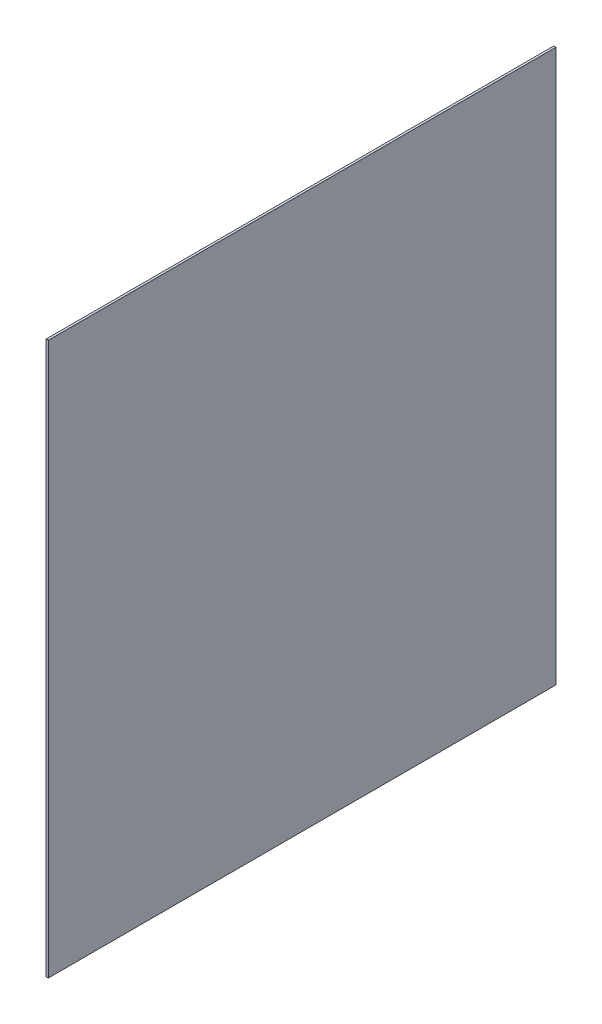
ISO-10303-21;
HEADER;
FILE_DESCRIPTION(('STEP AP214'),'2;1');
FILE_NAME('part.step','',(''),(''),'','','');
FILE_SCHEMA(('AUTOMOTIVE_DESIGN { 1 0 10303 214 1 1 1 1 }'));
ENDSEC;
DATA;
#1=APPLICATION_CONTEXT('core data for automotive mechanical design processes');
#2=APPLICATION_PROTOCOL_DEFINITION('international standard','automotive_design',2000,#1);
#3=PRODUCT_CONTEXT('',#1,'mechanical');
#4=PRODUCT('Part','Part','',(#3));
#5=PRODUCT_RELATED_PRODUCT_CATEGORY('part','',(#4));
#6=PRODUCT_DEFINITION_FORMATION('','',#4);
#7=PRODUCT_DEFINITION_CONTEXT('part definition',#1,'design');
#8=PRODUCT_DEFINITION('design','',#6,#7);
#9=PRODUCT_DEFINITION_SHAPE('','',#8);
#10=(LENGTH_UNIT() NAMED_UNIT(*) SI_UNIT(.MILLI.,.METRE.));
#11=(NAMED_UNIT(*) PLANE_ANGLE_UNIT() SI_UNIT($,.RADIAN.));
#12=(NAMED_UNIT(*) SI_UNIT($,.STERADIAN.) SOLID_ANGLE_UNIT());
#13=UNCERTAINTY_MEASURE_WITH_UNIT(LENGTH_MEASURE(1.E-05),#10,'distance_accuracy_value','');
#14=(GEOMETRIC_REPRESENTATION_CONTEXT(3) GLOBAL_UNCERTAINTY_ASSIGNED_CONTEXT((#13)) GLOBAL_UNIT_ASSIGNED_CONTEXT((#10,
#11,#12)) REPRESENTATION_CONTEXT('',''));
#15=CARTESIAN_POINT('',(0.,0.,0.));
#16=DIRECTION('',(0.,0.,1.));
#17=DIRECTION('',(1.,0.,0.));
#18=AXIS2_PLACEMENT_3D('',#15,#16,#17);
#19=CARTESIAN_POINT('',(664.,185.,440.));
#20=DIRECTION('',(0.,0.,-1.));
#21=DIRECTION('',(0.,1.,0.));
#22=AXIS2_PLACEMENT_3D('',#19,#20,#21);
#23=PLANE('',#22);
#24=DIRECTION('',(0.,-1.,0.));
#25=VECTOR('',#24,1.);
#26=CARTESIAN_POINT('',(662.5,185.,440.));
#27=LINE('',#26,#25);
#28=CARTESIAN_POINT('',(662.5,185.,440.));
#29=VERTEX_POINT('',#28);
#30=CARTESIAN_POINT('',(662.5,-185.,440.));
#31=VERTEX_POINT('',#30);
#32=EDGE_CURVE('E97',#29,#31,#27,.T.);
#33=ORIENTED_EDGE('',*,*,#32,.T.);
#34=DIRECTION('',(-1.,0.,0.));
#35=VECTOR('',#34,1.);
#36=CARTESIAN_POINT('',(664.,-185.,440.));
#37=LINE('',#36,#35);
#38=CARTESIAN_POINT('',(664.,-185.,440.));
#39=VERTEX_POINT('',#38);
#40=EDGE_CURVE('E11',#39,#31,#37,.T.);
#41=ORIENTED_EDGE('',*,*,#40,.F.);
#42=DIRECTION('',(0.,-1.,0.));
#43=VECTOR('',#42,1.);
#44=CARTESIAN_POINT('',(664.,185.,440.));
#45=LINE('',#44,#43);
#46=CARTESIAN_POINT('',(664.,185.,440.));
#47=VERTEX_POINT('',#46);
#48=EDGE_CURVE('E85',#47,#39,#45,.T.);
#49=ORIENTED_EDGE('',*,*,#48,.F.);
#50=DIRECTION('',(-1.,0.,0.));
#51=VECTOR('',#50,1.);
#52=CARTESIAN_POINT('',(664.,185.,440.));
#53=LINE('',#52,#51);
#54=EDGE_CURVE('E93',#47,#29,#53,.T.);
#55=ORIENTED_EDGE('',*,*,#54,.T.);
#56=EDGE_LOOP('',(#33,#41,#49,#55));
#57=FACE_BOUND('',#56,.T.);
#58=ADVANCED_FACE('F34',(#57),#23,.F.);
#59=CARTESIAN_POINT('',(664.,-185.,440.));
#60=DIRECTION('',(0.,1.,0.));
#61=DIRECTION('',(0.,0.,1.));
#62=AXIS2_PLACEMENT_3D('',#59,#60,#61);
#63=PLANE('',#62);
#64=DIRECTION('',(0.,0.,-1.));
#65=VECTOR('',#64,1.);
#66=CARTESIAN_POINT('',(662.5,-185.,440.));
#67=LINE('',#66,#65);
#68=CARTESIAN_POINT('',(662.5,-185.,100.));
#69=VERTEX_POINT('',#68);
#70=EDGE_CURVE('E89',#31,#69,#67,.T.);
#71=ORIENTED_EDGE('',*,*,#70,.T.);
#72=DIRECTION('',(-1.,0.,0.));
#73=VECTOR('',#72,1.);
#74=CARTESIAN_POINT('',(664.,-185.,100.));
#75=LINE('',#74,#73);
#76=CARTESIAN_POINT('',(664.,-185.,100.));
#77=VERTEX_POINT('',#76);
#78=EDGE_CURVE('E42',#77,#69,#75,.T.);
#79=ORIENTED_EDGE('',*,*,#78,.F.);
#80=DIRECTION('',(0.,0.,-1.));
#81=VECTOR('',#80,1.);
#82=CARTESIAN_POINT('',(664.,-185.,440.));
#83=LINE('',#82,#81);
#84=EDGE_CURVE('E80',#39,#77,#83,.T.);
#85=ORIENTED_EDGE('',*,*,#84,.F.);
#86=ORIENTED_EDGE('',*,*,#40,.T.);
#87=EDGE_LOOP('',(#71,#79,#85,#86));
#88=FACE_BOUND('',#87,.T.);
#89=ADVANCED_FACE('F88',(#88),#63,.F.);
#90=CARTESIAN_POINT('',(664.,-185.,100.));
#91=DIRECTION('',(0.,0.,1.));
#92=DIRECTION('',(1.,0.,0.));
#93=AXIS2_PLACEMENT_3D('',#90,#91,#92);
#94=PLANE('',#93);
#95=DIRECTION('',(0.,1.,0.));
#96=VECTOR('',#95,1.);
#97=CARTESIAN_POINT('',(662.5,-185.,100.));
#98=LINE('',#97,#96);
#99=CARTESIAN_POINT('',(662.5,185.,100.));
#100=VERTEX_POINT('',#99);
#101=EDGE_CURVE('E67',#69,#100,#98,.T.);
#102=ORIENTED_EDGE('',*,*,#101,.T.);
#103=DIRECTION('',(-1.,0.,0.));
#104=VECTOR('',#103,1.);
#105=CARTESIAN_POINT('',(664.,185.,100.));
#106=LINE('',#105,#104);
#107=CARTESIAN_POINT('',(664.,185.,100.));
#108=VERTEX_POINT('',#107);
#109=EDGE_CURVE('E90',#108,#100,#106,.T.);
#110=ORIENTED_EDGE('',*,*,#109,.F.);
#111=DIRECTION('',(0.,1.,0.));
#112=VECTOR('',#111,1.);
#113=CARTESIAN_POINT('',(664.,-185.,100.));
#114=LINE('',#113,#112);
#115=EDGE_CURVE('E83',#77,#108,#114,.T.);
#116=ORIENTED_EDGE('',*,*,#115,.F.);
#117=ORIENTED_EDGE('',*,*,#78,.T.);
#118=EDGE_LOOP('',(#102,#110,#116,#117));
#119=FACE_BOUND('',#118,.T.);
#120=ADVANCED_FACE('F91',(#119),#94,.F.);
#121=CARTESIAN_POINT('',(664.,185.,100.));
#122=DIRECTION('',(0.,-1.,0.));
#123=DIRECTION('',(0.,0.,-1.));
#124=AXIS2_PLACEMENT_3D('',#121,#122,#123);
#125=PLANE('',#124);
#126=DIRECTION('',(0.,0.,1.));
#127=VECTOR('',#126,1.);
#128=CARTESIAN_POINT('',(662.5,185.,100.));
#129=LINE('',#128,#127);
#130=EDGE_CURVE('E73',#100,#29,#129,.T.);
#131=ORIENTED_EDGE('',*,*,#130,.T.);
#132=ORIENTED_EDGE('',*,*,#54,.F.);
#133=DIRECTION('',(0.,0.,1.));
#134=VECTOR('',#133,1.);
#135=CARTESIAN_POINT('',(664.,185.,100.));
#136=LINE('',#135,#134);
#137=EDGE_CURVE('E50',#108,#47,#136,.T.);
#138=ORIENTED_EDGE('',*,*,#137,.F.);
#139=ORIENTED_EDGE('',*,*,#109,.T.);
#140=EDGE_LOOP('',(#131,#132,#138,#139));
#141=FACE_BOUND('',#140,.T.);
#142=ADVANCED_FACE('F104',(#141),#125,.F.);
#143=CARTESIAN_POINT('',(664.,0.,0.));
#144=DIRECTION('',(1.,0.,0.));
#145=DIRECTION('',(0.,0.,-1.));
#146=AXIS2_PLACEMENT_3D('',#143,#144,#145);
#147=PLANE('',#146);
#148=ORIENTED_EDGE('',*,*,#48,.T.);
#149=ORIENTED_EDGE('',*,*,#84,.T.);
#150=ORIENTED_EDGE('',*,*,#115,.T.);
#151=ORIENTED_EDGE('',*,*,#137,.T.);
#152=EDGE_LOOP('',(#148,#149,#150,#151));
#153=FACE_BOUND('',#152,.T.);
#154=ADVANCED_FACE('F81',(#153),#147,.T.);
#155=CARTESIAN_POINT('',(662.5,0.,0.));
#156=DIRECTION('',(1.,0.,0.));
#157=DIRECTION('',(0.,0.,-1.));
#158=AXIS2_PLACEMENT_3D('',#155,#156,#157);
#159=PLANE('',#158);
#160=ORIENTED_EDGE('',*,*,#32,.F.);
#161=ORIENTED_EDGE('',*,*,#130,.F.);
#162=ORIENTED_EDGE('',*,*,#101,.F.);
#163=ORIENTED_EDGE('',*,*,#70,.F.);
#164=EDGE_LOOP('',(#160,#161,#162,#163));
#165=FACE_BOUND('',#164,.T.);
#166=ADVANCED_FACE('F107',(#165),#159,.F.);
#167=CLOSED_SHELL('',(#58,#89,#120,#142,#154,#166));
#168=MANIFOLD_SOLID_BREP('B2',#167);
#169=ADVANCED_BREP_SHAPE_REPRESENTATION('',(#18,#168),#14);
#170=SHAPE_DEFINITION_REPRESENTATION(#9,#169);
ENDSEC;
END-ISO-10303-21;
